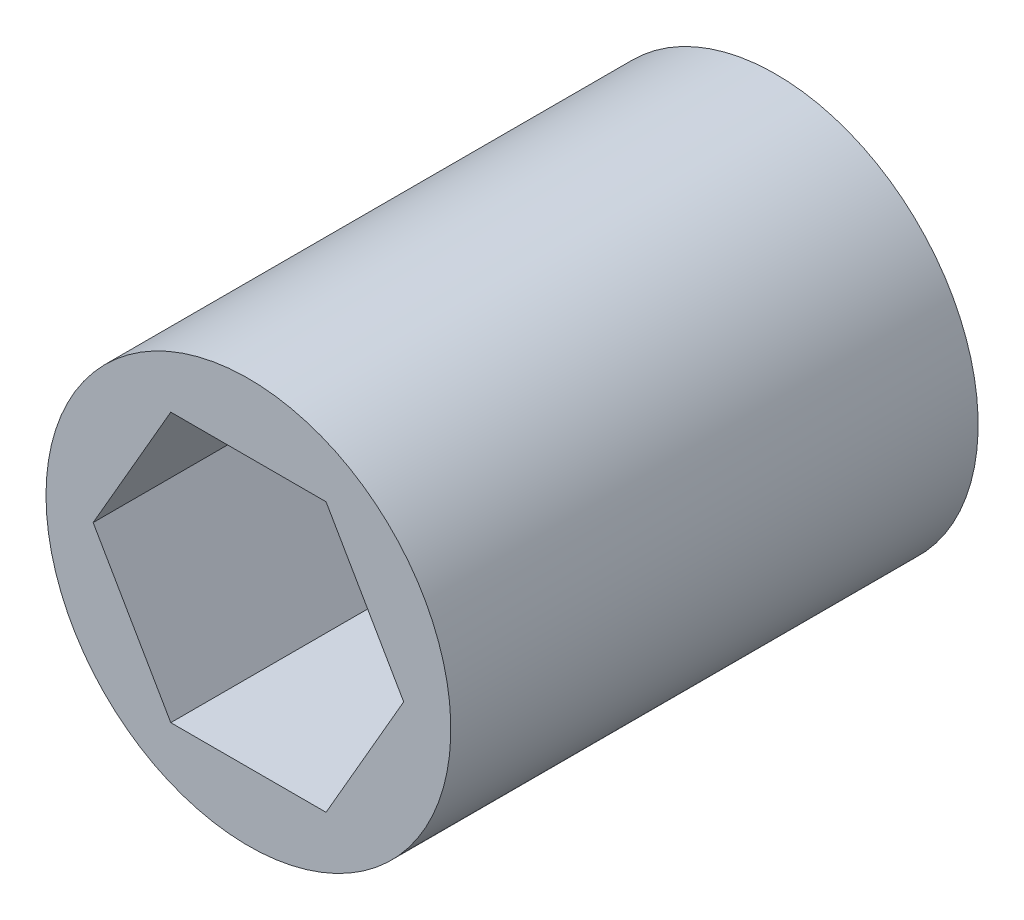
ISO-10303-21;
HEADER;
FILE_DESCRIPTION(('STEP AP214'),'2;1');
FILE_NAME('part.step','',(''),(''),'','','');
FILE_SCHEMA(('AUTOMOTIVE_DESIGN { 1 0 10303 214 1 1 1 1 }'));
ENDSEC;
DATA;
#1=APPLICATION_CONTEXT('core data for automotive mechanical design processes');
#2=APPLICATION_PROTOCOL_DEFINITION('international standard','automotive_design',2000,#1);
#3=PRODUCT_CONTEXT('',#1,'mechanical');
#4=PRODUCT('Part','Part','',(#3));
#5=PRODUCT_RELATED_PRODUCT_CATEGORY('part','',(#4));
#6=PRODUCT_DEFINITION_FORMATION('','',#4);
#7=PRODUCT_DEFINITION_CONTEXT('part definition',#1,'design');
#8=PRODUCT_DEFINITION('design','',#6,#7);
#9=PRODUCT_DEFINITION_SHAPE('','',#8);
#10=(LENGTH_UNIT() NAMED_UNIT(*) SI_UNIT(.MILLI.,.METRE.));
#11=(NAMED_UNIT(*) PLANE_ANGLE_UNIT() SI_UNIT($,.RADIAN.));
#12=(NAMED_UNIT(*) SI_UNIT($,.STERADIAN.) SOLID_ANGLE_UNIT());
#13=UNCERTAINTY_MEASURE_WITH_UNIT(LENGTH_MEASURE(1.E-05),#10,'distance_accuracy_value','');
#14=(GEOMETRIC_REPRESENTATION_CONTEXT(3) GLOBAL_UNCERTAINTY_ASSIGNED_CONTEXT((#13)) GLOBAL_UNIT_ASSIGNED_CONTEXT((#10,
#11,#12)) REPRESENTATION_CONTEXT('',''));
#15=CARTESIAN_POINT('',(0.,0.,0.));
#16=DIRECTION('',(0.,0.,1.));
#17=DIRECTION('',(1.,0.,0.));
#18=AXIS2_PLACEMENT_3D('',#15,#16,#17);
#19=CARTESIAN_POINT('',(-7.47899538708241,0.,12.7));
#20=DIRECTION('',(0.866025403784439,0.5,0.));
#21=DIRECTION('',(-0.5,0.866025403784439,0.));
#22=AXIS2_PLACEMENT_3D('',#19,#20,#21);
#23=PLANE('',#22);
#24=DIRECTION('',(-0.5,0.866025403784438,0.));
#25=VECTOR('',#24,1.);
#26=CARTESIAN_POINT('',(-3.73949769354121,-6.477,12.7));
#27=LINE('',#26,#25);
#28=CARTESIAN_POINT('',(-3.73949769354121,-6.477,12.7));
#29=VERTEX_POINT('',#28);
#30=CARTESIAN_POINT('',(-7.47899538708241,0.,12.7));
#31=VERTEX_POINT('',#30);
#32=EDGE_CURVE('E84',#29,#31,#27,.T.);
#33=ORIENTED_EDGE('',*,*,#32,.F.);
#34=DIRECTION('',(0.,0.,1.));
#35=VECTOR('',#34,1.);
#36=CARTESIAN_POINT('',(-3.73949769354121,-6.477,12.7));
#37=LINE('',#36,#35);
#38=CARTESIAN_POINT('',(-3.73949769354121,-6.477,-12.7));
#39=VERTEX_POINT('',#38);
#40=EDGE_CURVE('E76',#39,#29,#37,.T.);
#41=ORIENTED_EDGE('',*,*,#40,.F.);
#42=DIRECTION('',(-0.5,0.866025403784439,0.));
#43=VECTOR('',#42,1.);
#44=CARTESIAN_POINT('',(-3.73949769354121,-6.477,-12.7));
#45=LINE('',#44,#43);
#46=CARTESIAN_POINT('',(-7.47899538708241,0.,-12.7));
#47=VERTEX_POINT('',#46);
#48=EDGE_CURVE('E116',#39,#47,#45,.T.);
#49=ORIENTED_EDGE('',*,*,#48,.T.);
#50=DIRECTION('',(0.,0.,1.));
#51=VECTOR('',#50,1.);
#52=CARTESIAN_POINT('',(-7.47899538708241,0.,12.7));
#53=LINE('',#52,#51);
#54=EDGE_CURVE('E101',#31,#47,#53,.F.);
#55=ORIENTED_EDGE('',*,*,#54,.F.);
#56=EDGE_LOOP('',(#33,#41,#49,#55));
#57=FACE_BOUND('',#56,.T.);
#58=ADVANCED_FACE('F17',(#57),#23,.T.);
#59=CARTESIAN_POINT('',(-3.73949769354121,6.477,12.7));
#60=DIRECTION('',(0.866025403784439,-0.5,0.));
#61=DIRECTION('',(0.5,0.866025403784439,0.));
#62=AXIS2_PLACEMENT_3D('',#59,#60,#61);
#63=PLANE('',#62);
#64=DIRECTION('',(0.5,0.866025403784439,0.));
#65=VECTOR('',#64,1.);
#66=CARTESIAN_POINT('',(-7.47899538708242,0.,12.7));
#67=LINE('',#66,#65);
#68=CARTESIAN_POINT('',(-3.73949769354121,6.477,12.7));
#69=VERTEX_POINT('',#68);
#70=EDGE_CURVE('E109',#31,#69,#67,.T.);
#71=ORIENTED_EDGE('',*,*,#70,.F.);
#72=ORIENTED_EDGE('',*,*,#54,.T.);
#73=DIRECTION('',(0.5,0.866025403784439,0.));
#74=VECTOR('',#73,1.);
#75=CARTESIAN_POINT('',(-7.47899538708241,0.,-12.7));
#76=LINE('',#75,#74);
#77=CARTESIAN_POINT('',(-3.73949769354121,6.477,-12.7));
#78=VERTEX_POINT('',#77);
#79=EDGE_CURVE('E107',#47,#78,#76,.T.);
#80=ORIENTED_EDGE('',*,*,#79,.T.);
#81=DIRECTION('',(0.,0.,1.));
#82=VECTOR('',#81,1.);
#83=CARTESIAN_POINT('',(-3.73949769354121,6.477,12.7));
#84=LINE('',#83,#82);
#85=EDGE_CURVE('E98',#69,#78,#84,.F.);
#86=ORIENTED_EDGE('',*,*,#85,.F.);
#87=EDGE_LOOP('',(#71,#72,#80,#86));
#88=FACE_BOUND('',#87,.T.);
#89=ADVANCED_FACE('F106',(#88),#63,.T.);
#90=CARTESIAN_POINT('',(3.7394976935412,6.477,12.7));
#91=DIRECTION('',(0.,-1.,0.));
#92=DIRECTION('',(1.,0.,0.));
#93=AXIS2_PLACEMENT_3D('',#90,#91,#92);
#94=PLANE('',#93);
#95=DIRECTION('',(1.,0.,0.));
#96=VECTOR('',#95,1.);
#97=CARTESIAN_POINT('',(0.,6.477,12.7));
#98=LINE('',#97,#96);
#99=CARTESIAN_POINT('',(3.7394976935412,6.477,12.7));
#100=VERTEX_POINT('',#99);
#101=EDGE_CURVE('E126',#69,#100,#98,.T.);
#102=ORIENTED_EDGE('',*,*,#101,.F.);
#103=ORIENTED_EDGE('',*,*,#85,.T.);
#104=DIRECTION('',(1.,0.,0.));
#105=VECTOR('',#104,1.);
#106=CARTESIAN_POINT('',(0.,6.477,-12.7));
#107=LINE('',#106,#105);
#108=CARTESIAN_POINT('',(3.7394976935412,6.477,-12.7));
#109=VERTEX_POINT('',#108);
#110=EDGE_CURVE('E118',#78,#109,#107,.T.);
#111=ORIENTED_EDGE('',*,*,#110,.T.);
#112=DIRECTION('',(0.,0.,1.));
#113=VECTOR('',#112,1.);
#114=CARTESIAN_POINT('',(3.7394976935412,6.47700000000001,12.7));
#115=LINE('',#114,#113);
#116=EDGE_CURVE('E95',#100,#109,#115,.F.);
#117=ORIENTED_EDGE('',*,*,#116,.F.);
#118=EDGE_LOOP('',(#102,#103,#111,#117));
#119=FACE_BOUND('',#118,.T.);
#120=ADVANCED_FACE('F135',(#119),#94,.T.);
#121=CARTESIAN_POINT('',(7.47899538708241,0.,12.7));
#122=DIRECTION('',(-0.866025403784439,-0.5,0.));
#123=DIRECTION('',(0.5,-0.866025403784439,0.));
#124=AXIS2_PLACEMENT_3D('',#121,#122,#123);
#125=PLANE('',#124);
#126=DIRECTION('',(0.5,-0.866025403784438,0.));
#127=VECTOR('',#126,1.);
#128=CARTESIAN_POINT('',(3.7394976935412,6.477,12.7));
#129=LINE('',#128,#127);
#130=CARTESIAN_POINT('',(7.47899538708242,0.,12.7));
#131=VERTEX_POINT('',#130);
#132=EDGE_CURVE('E89',#100,#131,#129,.T.);
#133=ORIENTED_EDGE('',*,*,#132,.F.);
#134=ORIENTED_EDGE('',*,*,#116,.T.);
#135=DIRECTION('',(0.5,-0.866025403784438,0.));
#136=VECTOR('',#135,1.);
#137=CARTESIAN_POINT('',(3.7394976935412,6.477,-12.7));
#138=LINE('',#137,#136);
#139=CARTESIAN_POINT('',(7.47899538708241,0.,-12.7));
#140=VERTEX_POINT('',#139);
#141=EDGE_CURVE('E120',#109,#140,#138,.T.);
#142=ORIENTED_EDGE('',*,*,#141,.T.);
#143=DIRECTION('',(0.,0.,1.));
#144=VECTOR('',#143,1.);
#145=CARTESIAN_POINT('',(7.47899538708242,0.,12.7));
#146=LINE('',#145,#144);
#147=EDGE_CURVE('E65',#131,#140,#146,.F.);
#148=ORIENTED_EDGE('',*,*,#147,.F.);
#149=EDGE_LOOP('',(#133,#134,#142,#148));
#150=FACE_BOUND('',#149,.T.);
#151=ADVANCED_FACE('F132',(#150),#125,.T.);
#152=CARTESIAN_POINT('',(3.73949769354121,-6.477,12.7));
#153=DIRECTION('',(-0.866025403784439,0.5,0.));
#154=DIRECTION('',(-0.5,-0.866025403784439,0.));
#155=AXIS2_PLACEMENT_3D('',#152,#153,#154);
#156=PLANE('',#155);
#157=DIRECTION('',(-0.5,-0.866025403784439,0.));
#158=VECTOR('',#157,1.);
#159=CARTESIAN_POINT('',(7.47899538708241,0.,12.7));
#160=LINE('',#159,#158);
#161=CARTESIAN_POINT('',(3.73949769354121,-6.477,12.7));
#162=VERTEX_POINT('',#161);
#163=EDGE_CURVE('E71',#131,#162,#160,.T.);
#164=ORIENTED_EDGE('',*,*,#163,.F.);
#165=ORIENTED_EDGE('',*,*,#147,.T.);
#166=DIRECTION('',(-0.5,-0.866025403784439,0.));
#167=VECTOR('',#166,1.);
#168=CARTESIAN_POINT('',(7.47899538708241,0.,-12.7));
#169=LINE('',#168,#167);
#170=CARTESIAN_POINT('',(3.73949769354121,-6.477,-12.7));
#171=VERTEX_POINT('',#170);
#172=EDGE_CURVE('E33',#140,#171,#169,.T.);
#173=ORIENTED_EDGE('',*,*,#172,.T.);
#174=DIRECTION('',(0.,0.,1.));
#175=VECTOR('',#174,1.);
#176=CARTESIAN_POINT('',(3.73949769354121,-6.477,12.7));
#177=LINE('',#176,#175);
#178=EDGE_CURVE('E67',#162,#171,#177,.F.);
#179=ORIENTED_EDGE('',*,*,#178,.F.);
#180=EDGE_LOOP('',(#164,#165,#173,#179));
#181=FACE_BOUND('',#180,.T.);
#182=ADVANCED_FACE('F69',(#181),#156,.T.);
#183=CARTESIAN_POINT('',(-3.73949769354121,-6.477,12.7));
#184=DIRECTION('',(0.,1.,0.));
#185=DIRECTION('',(0.,0.,1.));
#186=AXIS2_PLACEMENT_3D('',#183,#184,#185);
#187=PLANE('',#186);
#188=DIRECTION('',(1.,0.,0.));
#189=VECTOR('',#188,1.);
#190=CARTESIAN_POINT('',(0.,-6.477,12.7));
#191=LINE('',#190,#189);
#192=EDGE_CURVE('E79',#162,#29,#191,.F.);
#193=ORIENTED_EDGE('',*,*,#192,.F.);
#194=ORIENTED_EDGE('',*,*,#178,.T.);
#195=DIRECTION('',(1.,0.,0.));
#196=VECTOR('',#195,1.);
#197=CARTESIAN_POINT('',(0.,-6.477,-12.7));
#198=LINE('',#197,#196);
#199=EDGE_CURVE('E128',#171,#39,#198,.F.);
#200=ORIENTED_EDGE('',*,*,#199,.T.);
#201=ORIENTED_EDGE('',*,*,#40,.T.);
#202=EDGE_LOOP('',(#193,#194,#200,#201));
#203=FACE_BOUND('',#202,.T.);
#204=ADVANCED_FACE('F80',(#203),#187,.T.);
#205=CARTESIAN_POINT('',(0.,0.,12.7));
#206=DIRECTION('',(0.,0.,1.));
#207=DIRECTION('',(1.,0.,0.));
#208=AXIS2_PLACEMENT_3D('',#205,#206,#207);
#209=PLANE('',#208);
#210=ORIENTED_EDGE('',*,*,#101,.T.);
#211=ORIENTED_EDGE('',*,*,#132,.T.);
#212=ORIENTED_EDGE('',*,*,#163,.T.);
#213=ORIENTED_EDGE('',*,*,#192,.T.);
#214=ORIENTED_EDGE('',*,*,#32,.T.);
#215=ORIENTED_EDGE('',*,*,#70,.T.);
#216=EDGE_LOOP('',(#210,#211,#212,#213,#214,#215));
#217=FACE_BOUND('',#216,.T.);
#218=CARTESIAN_POINT('',(0.,0.,12.7));
#219=DIRECTION('',(0.,0.,-1.));
#220=DIRECTION('',(-1.,0.,0.));
#221=AXIS2_PLACEMENT_3D('',#218,#219,#220);
#222=CIRCLE('',#221,9.75);
#223=CARTESIAN_POINT('',(-9.75,0.,12.7));
#224=VERTEX_POINT('',#223);
#225=EDGE_CURVE('E20',#224,#224,#222,.T.);
#226=ORIENTED_EDGE('',*,*,#225,.F.);
#227=EDGE_LOOP('',(#226));
#228=FACE_BOUND('',#227,.T.);
#229=ADVANCED_FACE('F87',(#217,#228),#209,.T.);
#230=CARTESIAN_POINT('',(0.,0.,-12.7));
#231=DIRECTION('',(0.,0.,1.));
#232=DIRECTION('',(1.,0.,0.));
#233=AXIS2_PLACEMENT_3D('',#230,#231,#232);
#234=PLANE('',#233);
#235=ORIENTED_EDGE('',*,*,#172,.F.);
#236=ORIENTED_EDGE('',*,*,#141,.F.);
#237=ORIENTED_EDGE('',*,*,#110,.F.);
#238=ORIENTED_EDGE('',*,*,#79,.F.);
#239=ORIENTED_EDGE('',*,*,#48,.F.);
#240=ORIENTED_EDGE('',*,*,#199,.F.);
#241=EDGE_LOOP('',(#235,#236,#237,#238,#239,#240));
#242=FACE_BOUND('',#241,.T.);
#243=CARTESIAN_POINT('',(0.,0.,-12.7));
#244=DIRECTION('',(0.,0.,-1.));
#245=DIRECTION('',(-1.,0.,0.));
#246=AXIS2_PLACEMENT_3D('',#243,#244,#245);
#247=CIRCLE('',#246,9.75);
#248=CARTESIAN_POINT('',(-9.75,0.,-12.7));
#249=VERTEX_POINT('',#248);
#250=EDGE_CURVE('E11',#249,#249,#247,.F.);
#251=ORIENTED_EDGE('',*,*,#250,.F.);
#252=EDGE_LOOP('',(#251));
#253=FACE_BOUND('',#252,.T.);
#254=ADVANCED_FACE('F114',(#242,#253),#234,.F.);
#255=CARTESIAN_POINT('',(0.,0.,12.7));
#256=DIRECTION('',(0.,0.,-1.));
#257=DIRECTION('',(-1.,0.,0.));
#258=AXIS2_PLACEMENT_3D('',#255,#256,#257);
#259=CYLINDRICAL_SURFACE('',#258,9.75);
#260=ORIENTED_EDGE('',*,*,#250,.T.);
#261=EDGE_LOOP('',(#260));
#262=FACE_BOUND('',#261,.T.);
#263=ORIENTED_EDGE('',*,*,#225,.T.);
#264=EDGE_LOOP('',(#263));
#265=FACE_BOUND('',#264,.T.);
#266=ADVANCED_FACE('F144',(#262,#265),#259,.T.);
#267=CLOSED_SHELL('',(#58,#89,#120,#151,#182,#204,#229,#254,#266));
#268=MANIFOLD_SOLID_BREP('B1',#267);
#269=ADVANCED_BREP_SHAPE_REPRESENTATION('',(#18,#268),#14);
#270=SHAPE_DEFINITION_REPRESENTATION(#9,#269);
ENDSEC;
END-ISO-10303-21;
